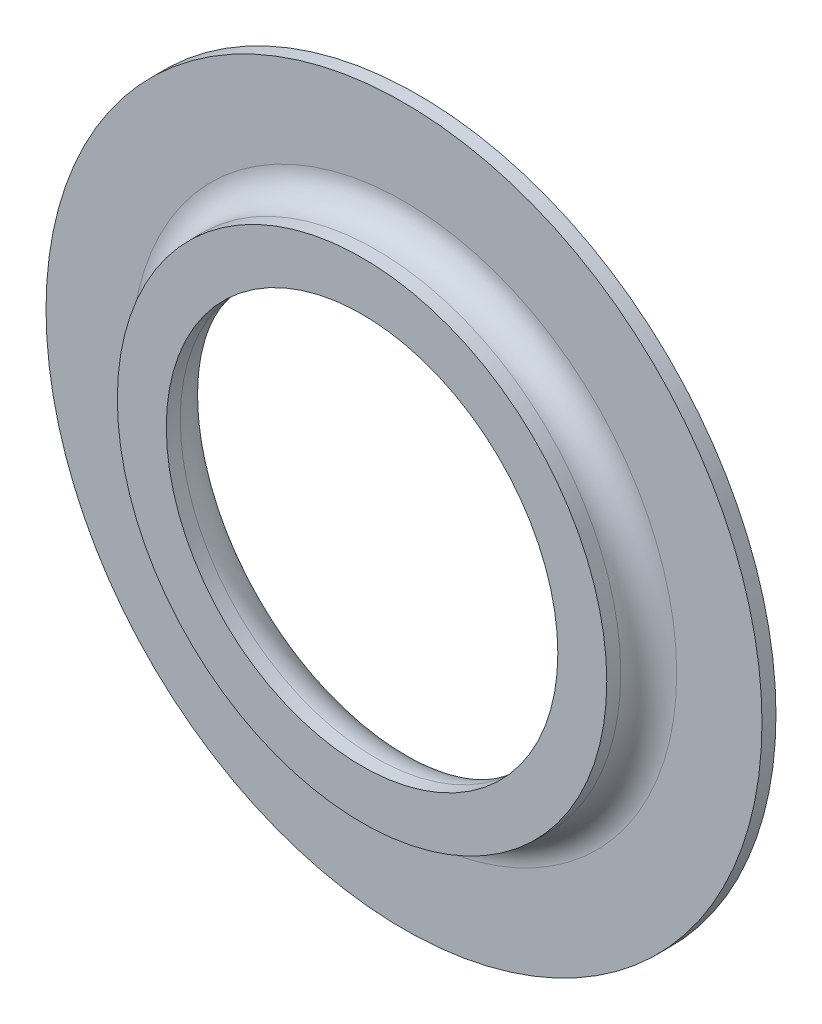
ISO-10303-21;
HEADER;
FILE_DESCRIPTION(('STEP AP214'),'2;1');
FILE_NAME('part.step','',(''),(''),'','','');
FILE_SCHEMA(('AUTOMOTIVE_DESIGN { 1 0 10303 214 1 1 1 1 }'));
ENDSEC;
DATA;
#1=APPLICATION_CONTEXT('core data for automotive mechanical design processes');
#2=APPLICATION_PROTOCOL_DEFINITION('international standard','automotive_design',2000,#1);
#3=PRODUCT_CONTEXT('',#1,'mechanical');
#4=PRODUCT('Part','Part','',(#3));
#5=PRODUCT_RELATED_PRODUCT_CATEGORY('part','',(#4));
#6=PRODUCT_DEFINITION_FORMATION('','',#4);
#7=PRODUCT_DEFINITION_CONTEXT('part definition',#1,'design');
#8=PRODUCT_DEFINITION('design','',#6,#7);
#9=PRODUCT_DEFINITION_SHAPE('','',#8);
#10=(LENGTH_UNIT() NAMED_UNIT(*) SI_UNIT(.MILLI.,.METRE.));
#11=(NAMED_UNIT(*) PLANE_ANGLE_UNIT() SI_UNIT($,.RADIAN.));
#12=(NAMED_UNIT(*) SI_UNIT($,.STERADIAN.) SOLID_ANGLE_UNIT());
#13=UNCERTAINTY_MEASURE_WITH_UNIT(LENGTH_MEASURE(1.E-05),#10,'distance_accuracy_value','');
#14=(GEOMETRIC_REPRESENTATION_CONTEXT(3) GLOBAL_UNCERTAINTY_ASSIGNED_CONTEXT((#13)) GLOBAL_UNIT_ASSIGNED_CONTEXT((#10,
#11,#12)) REPRESENTATION_CONTEXT('',''));
#15=CARTESIAN_POINT('',(0.,0.,0.));
#16=DIRECTION('',(0.,0.,1.));
#17=DIRECTION('',(1.,0.,0.));
#18=AXIS2_PLACEMENT_3D('',#15,#16,#17);
#19=CARTESIAN_POINT('',(0.,0.,1.));
#20=DIRECTION('',(0.,0.,1.));
#21=DIRECTION('',(1.,0.,0.));
#22=AXIS2_PLACEMENT_3D('',#19,#20,#21);
#23=PLANE('',#22);
#24=CARTESIAN_POINT('',(0.,0.,1.));
#25=DIRECTION('',(0.,0.,1.));
#26=DIRECTION('',(1.,0.,0.));
#27=AXIS2_PLACEMENT_3D('',#24,#25,#26);
#28=CIRCLE('',#27,19.5);
#29=CARTESIAN_POINT('',(19.5,0.,1.));
#30=VERTEX_POINT('',#29);
#31=EDGE_CURVE('E50',#30,#30,#28,.F.);
#32=ORIENTED_EDGE('',*,*,#31,.T.);
#33=EDGE_LOOP('',(#32));
#34=FACE_BOUND('',#33,.T.);
#35=CARTESIAN_POINT('',(0.,0.,1.));
#36=DIRECTION('',(0.,0.,1.));
#37=DIRECTION('',(1.,0.,0.));
#38=AXIS2_PLACEMENT_3D('',#35,#36,#37);
#39=CIRCLE('',#38,25.6);
#40=CARTESIAN_POINT('',(25.6,0.,1.));
#41=VERTEX_POINT('',#40);
#42=EDGE_CURVE('E59',#41,#41,#39,.T.);
#43=ORIENTED_EDGE('',*,*,#42,.T.);
#44=EDGE_LOOP('',(#43));
#45=FACE_BOUND('',#44,.T.);
#46=ADVANCED_FACE('F39',(#34,#45),#23,.T.);
#47=CARTESIAN_POINT('',(0.,0.,0.));
#48=DIRECTION('',(0.,0.,1.));
#49=DIRECTION('',(1.,0.,0.));
#50=AXIS2_PLACEMENT_3D('',#47,#48,#49);
#51=PLANE('',#50);
#52=CARTESIAN_POINT('',(0.,0.,0.));
#53=DIRECTION('',(0.,0.,1.));
#54=DIRECTION('',(1.,0.,0.));
#55=AXIS2_PLACEMENT_3D('',#52,#53,#54);
#56=CIRCLE('',#55,17.);
#57=CARTESIAN_POINT('',(17.,0.,0.));
#58=VERTEX_POINT('',#57);
#59=EDGE_CURVE('E46',#58,#58,#56,.T.);
#60=ORIENTED_EDGE('',*,*,#59,.T.);
#61=EDGE_LOOP('',(#60));
#62=FACE_BOUND('',#61,.T.);
#63=CARTESIAN_POINT('',(0.,0.,0.));
#64=DIRECTION('',(0.,0.,1.));
#65=DIRECTION('',(1.,0.,0.));
#66=AXIS2_PLACEMENT_3D('',#63,#64,#65);
#67=CIRCLE('',#66,25.6);
#68=CARTESIAN_POINT('',(25.6,0.,0.));
#69=VERTEX_POINT('',#68);
#70=EDGE_CURVE('E60',#69,#69,#67,.T.);
#71=ORIENTED_EDGE('',*,*,#70,.F.);
#72=EDGE_LOOP('',(#71));
#73=FACE_BOUND('',#72,.T.);
#74=ADVANCED_FACE('F89',(#62,#73),#51,.F.);
#75=CARTESIAN_POINT('',(0.,0.,1.));
#76=DIRECTION('',(0.,0.,-1.));
#77=DIRECTION('',(-1.,0.,0.));
#78=AXIS2_PLACEMENT_3D('',#75,#76,#77);
#79=CYLINDRICAL_SURFACE('',#78,25.6);
#80=ORIENTED_EDGE('',*,*,#42,.F.);
#81=EDGE_LOOP('',(#80));
#82=FACE_BOUND('',#81,.T.);
#83=ORIENTED_EDGE('',*,*,#70,.T.);
#84=EDGE_LOOP('',(#83));
#85=FACE_BOUND('',#84,.T.);
#86=ADVANCED_FACE('F86',(#82,#85),#79,.T.);
#87=CARTESIAN_POINT('',(0.,0.,1.));
#88=DIRECTION('',(0.,0.,-1.));
#89=DIRECTION('',(-1.,0.,0.));
#90=AXIS2_PLACEMENT_3D('',#87,#88,#89);
#91=CYLINDRICAL_SURFACE('',#90,14.);
#92=CARTESIAN_POINT('',(0.,0.,3.));
#93=DIRECTION('',(0.,0.,1.));
#94=DIRECTION('',(1.,0.,0.));
#95=AXIS2_PLACEMENT_3D('',#92,#93,#94);
#96=CIRCLE('',#95,14.);
#97=CARTESIAN_POINT('',(14.,0.,3.));
#98=VERTEX_POINT('',#97);
#99=EDGE_CURVE('E10',#98,#98,#96,.F.);
#100=ORIENTED_EDGE('',*,*,#99,.T.);
#101=EDGE_LOOP('',(#100));
#102=FACE_BOUND('',#101,.T.);
#103=CARTESIAN_POINT('',(0.,0.,4.));
#104=DIRECTION('',(0.,0.,1.));
#105=DIRECTION('',(1.,0.,0.));
#106=AXIS2_PLACEMENT_3D('',#103,#104,#105);
#107=CIRCLE('',#106,14.);
#108=CARTESIAN_POINT('',(14.,0.,4.));
#109=VERTEX_POINT('',#108);
#110=EDGE_CURVE('E68',#109,#109,#107,.T.);
#111=ORIENTED_EDGE('',*,*,#110,.T.);
#112=EDGE_LOOP('',(#111));
#113=FACE_BOUND('',#112,.T.);
#114=ADVANCED_FACE('F72',(#102,#113),#91,.F.);
#115=CARTESIAN_POINT('',(0.,0.,4.));
#116=DIRECTION('',(0.,0.,1.));
#117=DIRECTION('',(1.,0.,0.));
#118=AXIS2_PLACEMENT_3D('',#115,#116,#117);
#119=PLANE('',#118);
#120=CARTESIAN_POINT('',(0.,0.,4.));
#121=DIRECTION('',(0.,0.,1.));
#122=DIRECTION('',(1.,0.,0.));
#123=AXIS2_PLACEMENT_3D('',#120,#121,#122);
#124=CIRCLE('',#123,17.5);
#125=CARTESIAN_POINT('',(17.5,0.,4.));
#126=VERTEX_POINT('',#125);
#127=EDGE_CURVE('E63',#126,#126,#124,.T.);
#128=ORIENTED_EDGE('',*,*,#127,.T.);
#129=EDGE_LOOP('',(#128));
#130=FACE_BOUND('',#129,.T.);
#131=ORIENTED_EDGE('',*,*,#110,.F.);
#132=EDGE_LOOP('',(#131));
#133=FACE_BOUND('',#132,.T.);
#134=ADVANCED_FACE('F74',(#130,#133),#119,.T.);
#135=CARTESIAN_POINT('',(0.,0.,4.));
#136=DIRECTION('',(0.,0.,-1.));
#137=DIRECTION('',(-1.,0.,0.));
#138=AXIS2_PLACEMENT_3D('',#135,#136,#137);
#139=CYLINDRICAL_SURFACE('',#138,17.5);
#140=CARTESIAN_POINT('',(0.,0.,3.));
#141=DIRECTION('',(0.,0.,1.));
#142=DIRECTION('',(1.,0.,0.));
#143=AXIS2_PLACEMENT_3D('',#140,#141,#142);
#144=CIRCLE('',#143,17.5);
#145=CARTESIAN_POINT('',(17.5,0.,3.));
#146=VERTEX_POINT('',#145);
#147=EDGE_CURVE('E54',#146,#146,#144,.T.);
#148=ORIENTED_EDGE('',*,*,#147,.T.);
#149=EDGE_LOOP('',(#148));
#150=FACE_BOUND('',#149,.T.);
#151=ORIENTED_EDGE('',*,*,#127,.F.);
#152=EDGE_LOOP('',(#151));
#153=FACE_BOUND('',#152,.T.);
#154=ADVANCED_FACE('F76',(#150,#153),#139,.T.);
#155=CARTESIAN_POINT('',(0.,0.,3.));
#156=DIRECTION('',(0.,0.,1.));
#157=DIRECTION('',(1.,0.,0.));
#158=AXIS2_PLACEMENT_3D('',#155,#156,#157);
#159=TOROIDAL_SURFACE('',#158,19.5,2.);
#160=ORIENTED_EDGE('',*,*,#31,.F.);
#161=EDGE_LOOP('',(#160));
#162=FACE_BOUND('',#161,.T.);
#163=ORIENTED_EDGE('',*,*,#147,.F.);
#164=EDGE_LOOP('',(#163));
#165=FACE_BOUND('',#164,.T.);
#166=ADVANCED_FACE('F83',(#162,#165),#159,.F.);
#167=CARTESIAN_POINT('',(0.,0.,3.));
#168=DIRECTION('',(0.,0.,1.));
#169=DIRECTION('',(1.,0.,0.));
#170=AXIS2_PLACEMENT_3D('',#167,#168,#169);
#171=TOROIDAL_SURFACE('',#170,17.,3.);
#172=ORIENTED_EDGE('',*,*,#99,.F.);
#173=EDGE_LOOP('',(#172));
#174=FACE_BOUND('',#173,.T.);
#175=ORIENTED_EDGE('',*,*,#59,.F.);
#176=EDGE_LOOP('',(#175));
#177=FACE_BOUND('',#176,.T.);
#178=ADVANCED_FACE('F41',(#174,#177),#171,.T.);
#179=CLOSED_SHELL('',(#46,#74,#86,#114,#134,#154,#166,#178));
#180=MANIFOLD_SOLID_BREP('B2',#179);
#181=ADVANCED_BREP_SHAPE_REPRESENTATION('',(#18,#180),#14);
#182=SHAPE_DEFINITION_REPRESENTATION(#9,#181);
ENDSEC;
END-ISO-10303-21;
